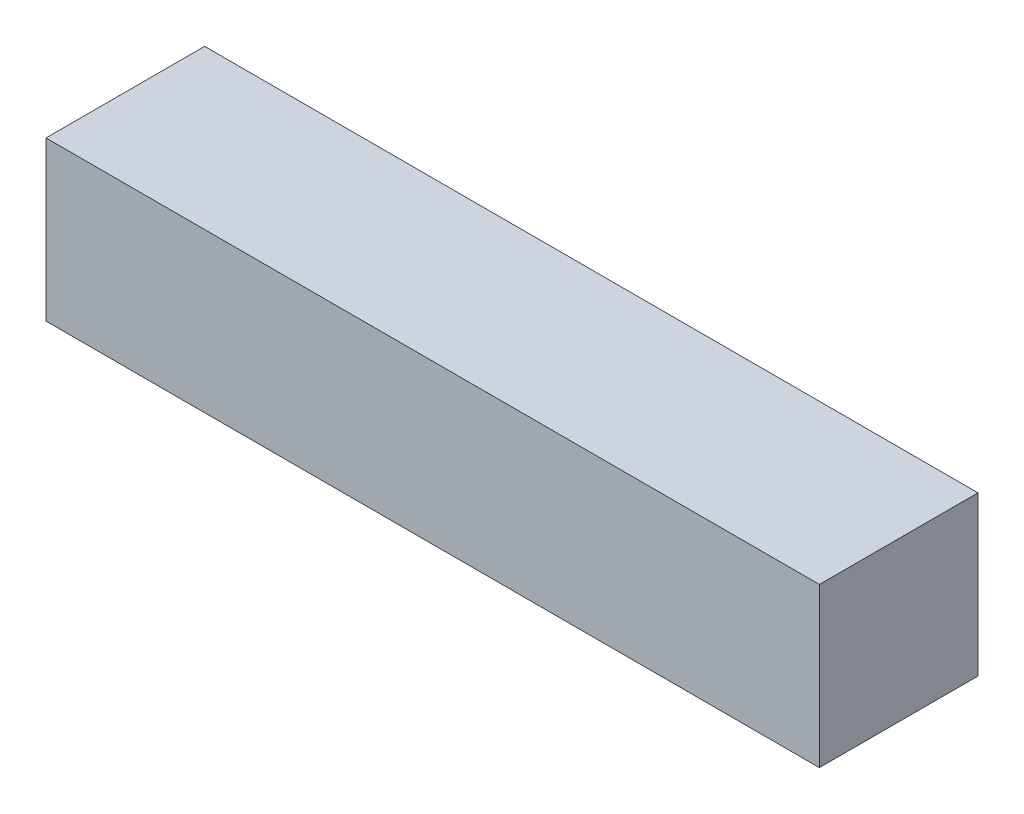
ISO-10303-21;
HEADER;
FILE_DESCRIPTION(('STEP AP214'),'2;1');
FILE_NAME('part.step','',(''),(''),'','','');
FILE_SCHEMA(('AUTOMOTIVE_DESIGN { 1 0 10303 214 1 1 1 1 }'));
ENDSEC;
DATA;
#1=APPLICATION_CONTEXT('core data for automotive mechanical design processes');
#2=APPLICATION_PROTOCOL_DEFINITION('international standard','automotive_design',2000,#1);
#3=PRODUCT_CONTEXT('',#1,'mechanical');
#4=PRODUCT('Part','Part','',(#3));
#5=PRODUCT_RELATED_PRODUCT_CATEGORY('part','',(#4));
#6=PRODUCT_DEFINITION_FORMATION('','',#4);
#7=PRODUCT_DEFINITION_CONTEXT('part definition',#1,'design');
#8=PRODUCT_DEFINITION('design','',#6,#7);
#9=PRODUCT_DEFINITION_SHAPE('','',#8);
#10=(LENGTH_UNIT() NAMED_UNIT(*) SI_UNIT(.MILLI.,.METRE.));
#11=(NAMED_UNIT(*) PLANE_ANGLE_UNIT() SI_UNIT($,.RADIAN.));
#12=(NAMED_UNIT(*) SI_UNIT($,.STERADIAN.) SOLID_ANGLE_UNIT());
#13=UNCERTAINTY_MEASURE_WITH_UNIT(LENGTH_MEASURE(1.E-05),#10,'distance_accuracy_value','');
#14=(GEOMETRIC_REPRESENTATION_CONTEXT(3) GLOBAL_UNCERTAINTY_ASSIGNED_CONTEXT((#13)) GLOBAL_UNIT_ASSIGNED_CONTEXT((#10,
#11,#12)) REPRESENTATION_CONTEXT('',''));
#15=CARTESIAN_POINT('',(0.,0.,0.));
#16=DIRECTION('',(0.,0.,1.));
#17=DIRECTION('',(1.,0.,0.));
#18=AXIS2_PLACEMENT_3D('',#15,#16,#17);
#19=CARTESIAN_POINT('',(292.138542064872,240.,190.));
#20=DIRECTION('',(1.,0.,0.));
#21=DIRECTION('',(0.,0.,1.));
#22=AXIS2_PLACEMENT_3D('',#19,#20,#21);
#23=PLANE('',#22);
#24=DIRECTION('',(0.,1.,0.));
#25=VECTOR('',#24,1.);
#26=CARTESIAN_POINT('',(292.138542064872,240.,430.));
#27=LINE('',#26,#25);
#28=CARTESIAN_POINT('',(292.138542064872,0.,430.));
#29=VERTEX_POINT('',#28);
#30=CARTESIAN_POINT('',(292.138542064872,240.,430.));
#31=VERTEX_POINT('',#30);
#32=EDGE_CURVE('E79',#29,#31,#27,.T.);
#33=ORIENTED_EDGE('',*,*,#32,.T.);
#34=DIRECTION('',(0.,0.,1.));
#35=VECTOR('',#34,1.);
#36=CARTESIAN_POINT('',(292.138542064872,240.,190.));
#37=LINE('',#36,#35);
#38=CARTESIAN_POINT('',(292.138542064872,240.,190.));
#39=VERTEX_POINT('',#38);
#40=EDGE_CURVE('E10',#39,#31,#37,.T.);
#41=ORIENTED_EDGE('',*,*,#40,.F.);
#42=DIRECTION('',(0.,1.,0.));
#43=VECTOR('',#42,1.);
#44=CARTESIAN_POINT('',(292.138542064872,240.,190.));
#45=LINE('',#44,#43);
#46=CARTESIAN_POINT('',(292.138542064872,0.,190.));
#47=VERTEX_POINT('',#46);
#48=EDGE_CURVE('E67',#47,#39,#45,.T.);
#49=ORIENTED_EDGE('',*,*,#48,.F.);
#50=DIRECTION('',(0.,0.,1.));
#51=VECTOR('',#50,1.);
#52=CARTESIAN_POINT('',(292.138542064872,0.,190.));
#53=LINE('',#52,#51);
#54=EDGE_CURVE('E75',#47,#29,#53,.T.);
#55=ORIENTED_EDGE('',*,*,#54,.T.);
#56=EDGE_LOOP('',(#33,#41,#49,#55));
#57=FACE_BOUND('',#56,.T.);
#58=ADVANCED_FACE('F16',(#57),#23,.F.);
#59=CARTESIAN_POINT('',(292.138542064872,240.,190.));
#60=DIRECTION('',(0.,-1.,0.));
#61=DIRECTION('',(0.,0.,-1.));
#62=AXIS2_PLACEMENT_3D('',#59,#60,#61);
#63=PLANE('',#62);
#64=DIRECTION('',(1.,0.,0.));
#65=VECTOR('',#64,1.);
#66=CARTESIAN_POINT('',(292.138542064872,240.,430.));
#67=LINE('',#66,#65);
#68=CARTESIAN_POINT('',(1462.13854206487,240.,430.));
#69=VERTEX_POINT('',#68);
#70=EDGE_CURVE('E71',#31,#69,#67,.T.);
#71=ORIENTED_EDGE('',*,*,#70,.T.);
#72=DIRECTION('',(0.,0.,1.));
#73=VECTOR('',#72,1.);
#74=CARTESIAN_POINT('',(1462.13854206487,240.,190.));
#75=LINE('',#74,#73);
#76=CARTESIAN_POINT('',(1462.13854206487,240.,190.));
#77=VERTEX_POINT('',#76);
#78=EDGE_CURVE('E24',#77,#69,#75,.T.);
#79=ORIENTED_EDGE('',*,*,#78,.F.);
#80=DIRECTION('',(1.,0.,0.));
#81=VECTOR('',#80,1.);
#82=CARTESIAN_POINT('',(292.138542064872,240.,190.));
#83=LINE('',#82,#81);
#84=EDGE_CURVE('E62',#39,#77,#83,.T.);
#85=ORIENTED_EDGE('',*,*,#84,.F.);
#86=ORIENTED_EDGE('',*,*,#40,.T.);
#87=EDGE_LOOP('',(#71,#79,#85,#86));
#88=FACE_BOUND('',#87,.T.);
#89=ADVANCED_FACE('F70',(#88),#63,.F.);
#90=CARTESIAN_POINT('',(1462.13854206487,240.,190.));
#91=DIRECTION('',(-1.,0.,0.));
#92=DIRECTION('',(0.,0.,-1.));
#93=AXIS2_PLACEMENT_3D('',#90,#91,#92);
#94=PLANE('',#93);
#95=DIRECTION('',(0.,-1.,0.));
#96=VECTOR('',#95,1.);
#97=CARTESIAN_POINT('',(1462.13854206487,240.,430.));
#98=LINE('',#97,#96);
#99=CARTESIAN_POINT('',(1462.13854206487,0.,430.));
#100=VERTEX_POINT('',#99);
#101=EDGE_CURVE('E49',#69,#100,#98,.T.);
#102=ORIENTED_EDGE('',*,*,#101,.T.);
#103=DIRECTION('',(0.,0.,1.));
#104=VECTOR('',#103,1.);
#105=CARTESIAN_POINT('',(1462.13854206487,0.,190.));
#106=LINE('',#105,#104);
#107=CARTESIAN_POINT('',(1462.13854206487,0.,190.));
#108=VERTEX_POINT('',#107);
#109=EDGE_CURVE('E72',#108,#100,#106,.T.);
#110=ORIENTED_EDGE('',*,*,#109,.F.);
#111=DIRECTION('',(0.,-1.,0.));
#112=VECTOR('',#111,1.);
#113=CARTESIAN_POINT('',(1462.13854206487,240.,190.));
#114=LINE('',#113,#112);
#115=EDGE_CURVE('E65',#77,#108,#114,.T.);
#116=ORIENTED_EDGE('',*,*,#115,.F.);
#117=ORIENTED_EDGE('',*,*,#78,.T.);
#118=EDGE_LOOP('',(#102,#110,#116,#117));
#119=FACE_BOUND('',#118,.T.);
#120=ADVANCED_FACE('F73',(#119),#94,.F.);
#121=CARTESIAN_POINT('',(292.138542064872,0.,190.));
#122=DIRECTION('',(0.,1.,0.));
#123=DIRECTION('',(0.,0.,1.));
#124=AXIS2_PLACEMENT_3D('',#121,#122,#123);
#125=PLANE('',#124);
#126=DIRECTION('',(-1.,0.,0.));
#127=VECTOR('',#126,1.);
#128=CARTESIAN_POINT('',(292.138542064872,0.,430.));
#129=LINE('',#128,#127);
#130=EDGE_CURVE('E55',#100,#29,#129,.T.);
#131=ORIENTED_EDGE('',*,*,#130,.T.);
#132=ORIENTED_EDGE('',*,*,#54,.F.);
#133=DIRECTION('',(-1.,0.,0.));
#134=VECTOR('',#133,1.);
#135=CARTESIAN_POINT('',(292.138542064872,0.,190.));
#136=LINE('',#135,#134);
#137=EDGE_CURVE('E32',#108,#47,#136,.T.);
#138=ORIENTED_EDGE('',*,*,#137,.F.);
#139=ORIENTED_EDGE('',*,*,#109,.T.);
#140=EDGE_LOOP('',(#131,#132,#138,#139));
#141=FACE_BOUND('',#140,.T.);
#142=ADVANCED_FACE('F86',(#141),#125,.F.);
#143=CARTESIAN_POINT('',(877.138542064872,240.,190.));
#144=DIRECTION('',(0.,0.,1.));
#145=DIRECTION('',(-1.,0.,0.));
#146=AXIS2_PLACEMENT_3D('',#143,#144,#145);
#147=PLANE('',#146);
#148=ORIENTED_EDGE('',*,*,#48,.T.);
#149=ORIENTED_EDGE('',*,*,#84,.T.);
#150=ORIENTED_EDGE('',*,*,#115,.T.);
#151=ORIENTED_EDGE('',*,*,#137,.T.);
#152=EDGE_LOOP('',(#148,#149,#150,#151));
#153=FACE_BOUND('',#152,.T.);
#154=ADVANCED_FACE('F63',(#153),#147,.F.);
#155=CARTESIAN_POINT('',(877.138542064872,240.,430.));
#156=DIRECTION('',(0.,0.,1.));
#157=DIRECTION('',(-1.,0.,0.));
#158=AXIS2_PLACEMENT_3D('',#155,#156,#157);
#159=PLANE('',#158);
#160=ORIENTED_EDGE('',*,*,#32,.F.);
#161=ORIENTED_EDGE('',*,*,#130,.F.);
#162=ORIENTED_EDGE('',*,*,#101,.F.);
#163=ORIENTED_EDGE('',*,*,#70,.F.);
#164=EDGE_LOOP('',(#160,#161,#162,#163));
#165=FACE_BOUND('',#164,.T.);
#166=ADVANCED_FACE('F89',(#165),#159,.T.);
#167=CLOSED_SHELL('',(#58,#89,#120,#142,#154,#166));
#168=MANIFOLD_SOLID_BREP('B1',#167);
#169=ADVANCED_BREP_SHAPE_REPRESENTATION('',(#18,#168),#14);
#170=SHAPE_DEFINITION_REPRESENTATION(#9,#169);
ENDSEC;
END-ISO-10303-21;
